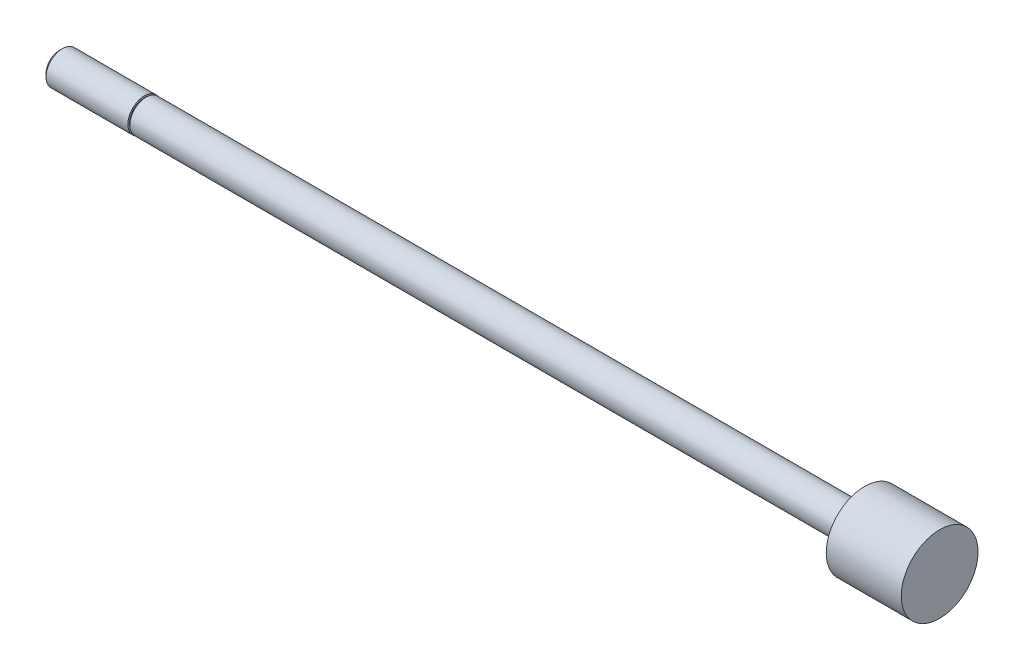
ISO-10303-21;
HEADER;
FILE_DESCRIPTION(('STEP AP214'),'2;1');
FILE_NAME('part.step','',(''),(''),'','','');
FILE_SCHEMA(('AUTOMOTIVE_DESIGN { 1 0 10303 214 1 1 1 1 }'));
ENDSEC;
DATA;
#1=APPLICATION_CONTEXT('core data for automotive mechanical design processes');
#2=APPLICATION_PROTOCOL_DEFINITION('international standard','automotive_design',2000,#1);
#3=PRODUCT_CONTEXT('',#1,'mechanical');
#4=PRODUCT('Part','Part','',(#3));
#5=PRODUCT_RELATED_PRODUCT_CATEGORY('part','',(#4));
#6=PRODUCT_DEFINITION_FORMATION('','',#4);
#7=PRODUCT_DEFINITION_CONTEXT('part definition',#1,'design');
#8=PRODUCT_DEFINITION('design','',#6,#7);
#9=PRODUCT_DEFINITION_SHAPE('','',#8);
#10=(LENGTH_UNIT() NAMED_UNIT(*) SI_UNIT(.MILLI.,.METRE.));
#11=(NAMED_UNIT(*) PLANE_ANGLE_UNIT() SI_UNIT($,.RADIAN.));
#12=(NAMED_UNIT(*) SI_UNIT($,.STERADIAN.) SOLID_ANGLE_UNIT());
#13=UNCERTAINTY_MEASURE_WITH_UNIT(LENGTH_MEASURE(1.E-05),#10,'distance_accuracy_value','');
#14=(GEOMETRIC_REPRESENTATION_CONTEXT(3) GLOBAL_UNCERTAINTY_ASSIGNED_CONTEXT((#13)) GLOBAL_UNIT_ASSIGNED_CONTEXT((#10,
#11,#12)) REPRESENTATION_CONTEXT('',''));
#15=CARTESIAN_POINT('',(0.,0.,0.));
#16=DIRECTION('',(0.,0.,1.));
#17=DIRECTION('',(1.,0.,0.));
#18=AXIS2_PLACEMENT_3D('',#15,#16,#17);
#19=CARTESIAN_POINT('',(116.078,0.,0.));
#20=DIRECTION('',(-1.,0.,0.));
#21=DIRECTION('',(0.,0.,1.));
#22=AXIS2_PLACEMENT_3D('',#19,#20,#21);
#23=CYLINDRICAL_SURFACE('',#22,2.3749);
#24=CARTESIAN_POINT('',(0.,0.,0.));
#25=DIRECTION('',(-1.,0.,0.));
#26=DIRECTION('',(0.,0.,1.));
#27=AXIS2_PLACEMENT_3D('',#24,#25,#26);
#28=CIRCLE('',#27,2.3749);
#29=CARTESIAN_POINT('',(0.,0.,2.3749));
#30=VERTEX_POINT('',#29);
#31=EDGE_CURVE('E55',#30,#30,#28,.T.);
#32=ORIENTED_EDGE('',*,*,#31,.F.);
#33=EDGE_LOOP('',(#32));
#34=FACE_BOUND('',#33,.T.);
#35=CARTESIAN_POINT('',(105.1052,0.,0.));
#36=DIRECTION('',(-1.,0.,0.));
#37=DIRECTION('',(0.,0.,1.));
#38=AXIS2_PLACEMENT_3D('',#35,#36,#37);
#39=CIRCLE('',#38,2.3749);
#40=CARTESIAN_POINT('',(105.1052,0.,2.3749));
#41=VERTEX_POINT('',#40);
#42=EDGE_CURVE('E10',#41,#41,#39,.T.);
#43=ORIENTED_EDGE('',*,*,#42,.T.);
#44=EDGE_LOOP('',(#43));
#45=FACE_BOUND('',#44,.T.);
#46=ADVANCED_FACE('F33',(#34,#45),#23,.T.);
#47=CARTESIAN_POINT('',(105.1052,2.3749,0.));
#48=DIRECTION('',(1.,0.,0.));
#49=DIRECTION('',(0.,0.,-1.));
#50=AXIS2_PLACEMENT_3D('',#47,#48,#49);
#51=PLANE('',#50);
#52=ORIENTED_EDGE('',*,*,#42,.F.);
#53=EDGE_LOOP('',(#52));
#54=FACE_BOUND('',#53,.T.);
#55=CARTESIAN_POINT('',(105.1052,0.,0.));
#56=DIRECTION('',(-1.,0.,0.));
#57=DIRECTION('',(0.,0.,1.));
#58=AXIS2_PLACEMENT_3D('',#55,#56,#57);
#59=CIRCLE('',#58,5.61975);
#60=CARTESIAN_POINT('',(105.1052,0.,5.61975));
#61=VERTEX_POINT('',#60);
#62=EDGE_CURVE('E40',#61,#61,#59,.T.);
#63=ORIENTED_EDGE('',*,*,#62,.T.);
#64=EDGE_LOOP('',(#63));
#65=FACE_BOUND('',#64,.T.);
#66=ADVANCED_FACE('F76',(#54,#65),#51,.F.);
#67=CARTESIAN_POINT('',(116.078,0.,0.));
#68=DIRECTION('',(-1.,0.,0.));
#69=DIRECTION('',(0.,0.,1.));
#70=AXIS2_PLACEMENT_3D('',#67,#68,#69);
#71=CYLINDRICAL_SURFACE('',#70,5.61975);
#72=ORIENTED_EDGE('',*,*,#62,.F.);
#73=EDGE_LOOP('',(#72));
#74=FACE_BOUND('',#73,.T.);
#75=CARTESIAN_POINT('',(116.078,0.,0.));
#76=DIRECTION('',(-1.,0.,0.));
#77=DIRECTION('',(0.,0.,1.));
#78=AXIS2_PLACEMENT_3D('',#75,#76,#77);
#79=CIRCLE('',#78,5.61975);
#80=CARTESIAN_POINT('',(116.078,0.,5.61975));
#81=VERTEX_POINT('',#80);
#82=EDGE_CURVE('E44',#81,#81,#79,.T.);
#83=ORIENTED_EDGE('',*,*,#82,.T.);
#84=EDGE_LOOP('',(#83));
#85=FACE_BOUND('',#84,.T.);
#86=ADVANCED_FACE('F80',(#74,#85),#71,.T.);
#87=CARTESIAN_POINT('',(116.078,5.61975,0.));
#88=DIRECTION('',(-1.,0.,0.));
#89=DIRECTION('',(0.,0.,1.));
#90=AXIS2_PLACEMENT_3D('',#87,#88,#89);
#91=PLANE('',#90);
#92=ORIENTED_EDGE('',*,*,#82,.F.);
#93=EDGE_LOOP('',(#92));
#94=FACE_BOUND('',#93,.T.);
#95=ADVANCED_FACE('F85',(#94),#91,.F.);
#96=CARTESIAN_POINT('',(-0.254,2.667,0.));
#97=DIRECTION('',(1.,0.,0.));
#98=DIRECTION('',(0.,0.,-1.));
#99=AXIS2_PLACEMENT_3D('',#96,#97,#98);
#100=PLANE('',#99);
#101=CARTESIAN_POINT('',(-0.254,0.,0.));
#102=DIRECTION('',(-1.,0.,0.));
#103=DIRECTION('',(0.,0.,1.));
#104=AXIS2_PLACEMENT_3D('',#101,#102,#103);
#105=CIRCLE('',#104,2.159);
#106=CARTESIAN_POINT('',(-0.254,0.,2.159));
#107=VERTEX_POINT('',#106);
#108=EDGE_CURVE('E58',#107,#107,#105,.T.);
#109=ORIENTED_EDGE('',*,*,#108,.T.);
#110=EDGE_LOOP('',(#109));
#111=FACE_BOUND('',#110,.T.);
#112=CARTESIAN_POINT('',(-0.254,0.,0.));
#113=DIRECTION('',(1.,0.,0.));
#114=DIRECTION('',(0.,0.,-1.));
#115=AXIS2_PLACEMENT_3D('',#112,#113,#114);
#116=CIRCLE('',#115,2.413);
#117=CARTESIAN_POINT('',(-0.254,0.,-2.413));
#118=VERTEX_POINT('',#117);
#119=EDGE_CURVE('E36',#118,#118,#116,.T.);
#120=ORIENTED_EDGE('',*,*,#119,.T.);
#121=EDGE_LOOP('',(#120));
#122=FACE_BOUND('',#121,.T.);
#123=ADVANCED_FACE('F71',(#111,#122),#100,.T.);
#124=CARTESIAN_POINT('',(0.,2.159,0.));
#125=DIRECTION('',(-1.,0.,0.));
#126=DIRECTION('',(0.,0.,1.));
#127=AXIS2_PLACEMENT_3D('',#124,#125,#126);
#128=PLANE('',#127);
#129=CARTESIAN_POINT('',(0.,0.,0.));
#130=DIRECTION('',(-1.,0.,0.));
#131=DIRECTION('',(0.,0.,1.));
#132=AXIS2_PLACEMENT_3D('',#129,#130,#131);
#133=CIRCLE('',#132,2.159);
#134=CARTESIAN_POINT('',(0.,0.,2.159));
#135=VERTEX_POINT('',#134);
#136=EDGE_CURVE('E61',#135,#135,#133,.T.);
#137=ORIENTED_EDGE('',*,*,#136,.F.);
#138=EDGE_LOOP('',(#137));
#139=FACE_BOUND('',#138,.T.);
#140=ORIENTED_EDGE('',*,*,#31,.T.);
#141=EDGE_LOOP('',(#140));
#142=FACE_BOUND('',#141,.T.);
#143=ADVANCED_FACE('F68',(#139,#142),#128,.T.);
#144=CARTESIAN_POINT('',(0.,0.,0.));
#145=DIRECTION('',(-1.,0.,0.));
#146=DIRECTION('',(0.,0.,1.));
#147=AXIS2_PLACEMENT_3D('',#144,#145,#146);
#148=CYLINDRICAL_SURFACE('',#147,2.159);
#149=ORIENTED_EDGE('',*,*,#136,.T.);
#150=EDGE_LOOP('',(#149));
#151=FACE_BOUND('',#150,.T.);
#152=ORIENTED_EDGE('',*,*,#108,.F.);
#153=EDGE_LOOP('',(#152));
#154=FACE_BOUND('',#153,.T.);
#155=ADVANCED_FACE('F65',(#151,#154),#148,.T.);
#156=CARTESIAN_POINT('',(-12.7,0.,0.));
#157=DIRECTION('',(1.,0.,0.));
#158=DIRECTION('',(0.,0.,-1.));
#159=AXIS2_PLACEMENT_3D('',#156,#157,#158);
#160=PLANE('',#159);
#161=CARTESIAN_POINT('',(-12.7,0.,0.));
#162=DIRECTION('',(-1.,0.,0.));
#163=DIRECTION('',(0.,0.,1.));
#164=AXIS2_PLACEMENT_3D('',#161,#162,#163);
#165=CIRCLE('',#164,1.94056);
#166=CARTESIAN_POINT('',(-12.7,0.,1.94056));
#167=VERTEX_POINT('',#166);
#168=EDGE_CURVE('E49',#167,#167,#165,.T.);
#169=ORIENTED_EDGE('',*,*,#168,.T.);
#170=EDGE_LOOP('',(#169));
#171=FACE_BOUND('',#170,.T.);
#172=ADVANCED_FACE('F93',(#171),#160,.F.);
#173=CARTESIAN_POINT('',(-12.22756,0.,0.));
#174=DIRECTION('',(1.,0.,0.));
#175=DIRECTION('',(0.,0.,-1.));
#176=AXIS2_PLACEMENT_3D('',#173,#174,#175);
#177=CONICAL_SURFACE('',#176,2.413,0.785398163397449);
#178=ORIENTED_EDGE('',*,*,#168,.F.);
#179=EDGE_LOOP('',(#178));
#180=FACE_BOUND('',#179,.T.);
#181=CARTESIAN_POINT('',(-12.22756,0.,0.));
#182=DIRECTION('',(-1.,0.,0.));
#183=DIRECTION('',(0.,0.,1.));
#184=AXIS2_PLACEMENT_3D('',#181,#182,#183);
#185=CIRCLE('',#184,2.413);
#186=CARTESIAN_POINT('',(-12.22756,0.,2.413));
#187=VERTEX_POINT('',#186);
#188=EDGE_CURVE('E52',#187,#187,#185,.T.);
#189=ORIENTED_EDGE('',*,*,#188,.T.);
#190=EDGE_LOOP('',(#189));
#191=FACE_BOUND('',#190,.T.);
#192=ADVANCED_FACE('F96',(#180,#191),#177,.T.);
#193=CARTESIAN_POINT('',(0.,0.,0.));
#194=DIRECTION('',(-1.,0.,0.));
#195=DIRECTION('',(0.,0.,1.));
#196=AXIS2_PLACEMENT_3D('',#193,#194,#195);
#197=CYLINDRICAL_SURFACE('',#196,2.413);
#198=ORIENTED_EDGE('',*,*,#188,.F.);
#199=EDGE_LOOP('',(#198));
#200=FACE_BOUND('',#199,.T.);
#201=ORIENTED_EDGE('',*,*,#119,.F.);
#202=EDGE_LOOP('',(#201));
#203=FACE_BOUND('',#202,.T.);
#204=ADVANCED_FACE('F100',(#200,#203),#197,.T.);
#205=CLOSED_SHELL('',(#46,#66,#86,#95,#123,#143,#155,#172,#192,#204));
#206=MANIFOLD_SOLID_BREP('B2',#205);
#207=ADVANCED_BREP_SHAPE_REPRESENTATION('',(#18,#206),#14);
#208=SHAPE_DEFINITION_REPRESENTATION(#9,#207);
ENDSEC;
END-ISO-10303-21;
